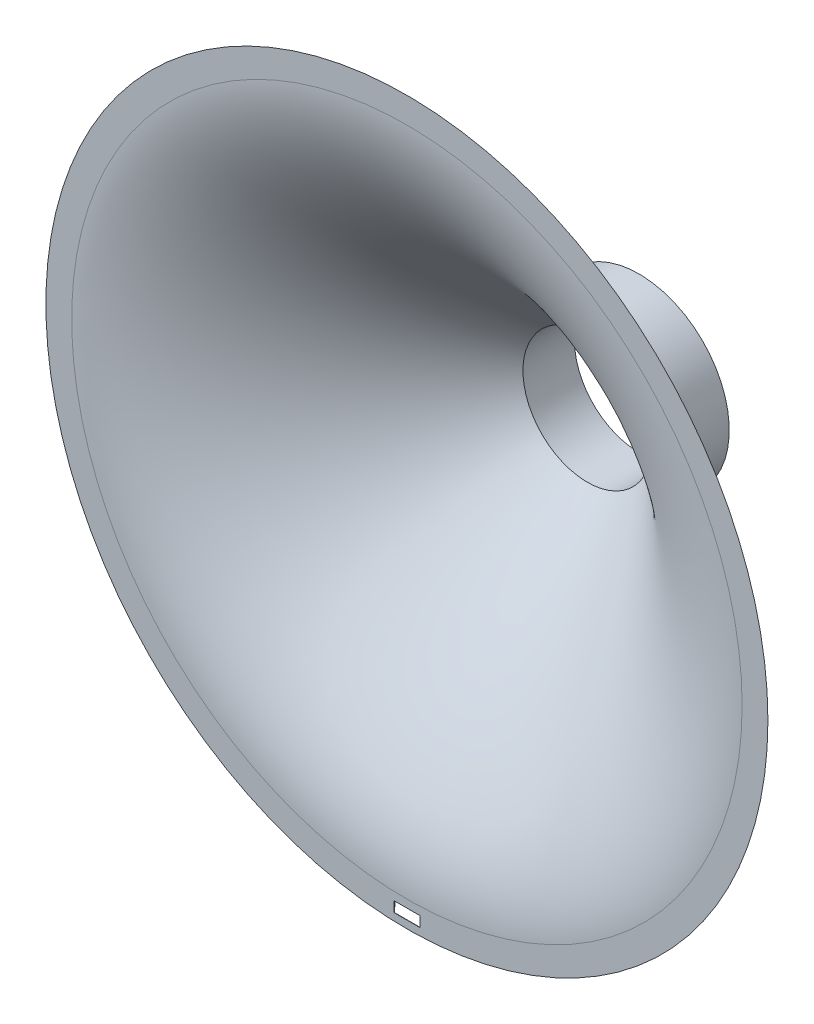
ISO-10303-21;
HEADER;
FILE_DESCRIPTION(('STEP AP214'),'2;1');
FILE_NAME('part.step','',(''),(''),'','','');
FILE_SCHEMA(('AUTOMOTIVE_DESIGN { 1 0 10303 214 1 1 1 1 }'));
ENDSEC;
DATA;
#1=APPLICATION_CONTEXT('core data for automotive mechanical design processes');
#2=APPLICATION_PROTOCOL_DEFINITION('international standard','automotive_design',2000,#1);
#3=PRODUCT_CONTEXT('',#1,'mechanical');
#4=PRODUCT('Part','Part','',(#3));
#5=PRODUCT_RELATED_PRODUCT_CATEGORY('part','',(#4));
#6=PRODUCT_DEFINITION_FORMATION('','',#4);
#7=PRODUCT_DEFINITION_CONTEXT('part definition',#1,'design');
#8=PRODUCT_DEFINITION('design','',#6,#7);
#9=PRODUCT_DEFINITION_SHAPE('','',#8);
#10=(LENGTH_UNIT() NAMED_UNIT(*) SI_UNIT(.MILLI.,.METRE.));
#11=(NAMED_UNIT(*) PLANE_ANGLE_UNIT() SI_UNIT($,.RADIAN.));
#12=(NAMED_UNIT(*) SI_UNIT($,.STERADIAN.) SOLID_ANGLE_UNIT());
#13=UNCERTAINTY_MEASURE_WITH_UNIT(LENGTH_MEASURE(1.E-05),#10,'distance_accuracy_value','');
#14=(GEOMETRIC_REPRESENTATION_CONTEXT(3) GLOBAL_UNCERTAINTY_ASSIGNED_CONTEXT((#13)) GLOBAL_UNIT_ASSIGNED_CONTEXT((#10,
#11,#12)) REPRESENTATION_CONTEXT('',''));
#15=CARTESIAN_POINT('',(0.,0.,0.));
#16=DIRECTION('',(0.,0.,1.));
#17=DIRECTION('',(1.,0.,0.));
#18=AXIS2_PLACEMENT_3D('',#15,#16,#17);
#19=CARTESIAN_POINT('',(0.,65.,0.));
#20=CARTESIAN_POINT('',(0.,47.4999999999999,0.));
#21=CARTESIAN_POINT('',(0.,24.8743686707647,-22.6256313292353));
#22=CARTESIAN_POINT('',(0.,12.5,-35.));
#23=B_SPLINE_CURVE_WITH_KNOTS('',3,(#19,#20,#21,#22),.UNSPECIFIED.,.F.,.F.,(4,4),(0.,1.),.UNSPECIFIED.);
#24=CARTESIAN_POINT('',(0.,0.,0.));
#25=DIRECTION('',(0.,0.,1.));
#26=AXIS1_PLACEMENT('',#24,#25);
#27=SURFACE_OF_REVOLUTION('',#23,#26);
#28=CARTESIAN_POINT('',(0.,0.,-35.));
#29=DIRECTION('',(0.,0.,1.));
#30=DIRECTION('',(1.,0.,0.));
#31=AXIS2_PLACEMENT_3D('',#28,#29,#30);
#32=CIRCLE('',#31,12.5);
#33=CARTESIAN_POINT('',(12.5,0.,-35.));
#34=VERTEX_POINT('',#33);
#35=EDGE_CURVE('E111',#34,#34,#32,.T.);
#36=ORIENTED_EDGE('',*,*,#35,.F.);
#37=EDGE_LOOP('',(#36));
#38=FACE_BOUND('',#37,.T.);
#39=CARTESIAN_POINT('',(0.,0.,0.));
#40=DIRECTION('',(0.,0.,1.));
#41=DIRECTION('',(1.,0.,0.));
#42=AXIS2_PLACEMENT_3D('',#39,#40,#41);
#43=CIRCLE('',#42,65.);
#44=CARTESIAN_POINT('',(65.,0.,0.));
#45=VERTEX_POINT('',#44);
#46=EDGE_CURVE('E181',#45,#45,#43,.T.);
#47=ORIENTED_EDGE('',*,*,#46,.T.);
#48=EDGE_LOOP('',(#47));
#49=FACE_BOUND('',#48,.T.);
#50=ADVANCED_FACE('F38',(#38,#49),#27,.T.);
#51=CARTESIAN_POINT('',(0.,65.,0.));
#52=DIRECTION('',(0.,0.,-1.));
#53=DIRECTION('',(-1.,0.,0.));
#54=AXIS2_PLACEMENT_3D('',#51,#52,#53);
#55=PLANE('',#54);
#56=DIRECTION('',(-1.,0.,0.));
#57=VECTOR('',#56,1.);
#58=CARTESIAN_POINT('',(-2.5,-66.5,0.));
#59=LINE('',#58,#57);
#60=CARTESIAN_POINT('',(2.5,-66.5,0.));
#61=VERTEX_POINT('',#60);
#62=CARTESIAN_POINT('',(-2.5,-66.5,0.));
#63=VERTEX_POINT('',#62);
#64=EDGE_CURVE('E97',#61,#63,#59,.T.);
#65=ORIENTED_EDGE('',*,*,#64,.F.);
#66=DIRECTION('',(0.,1.,0.));
#67=VECTOR('',#66,1.);
#68=CARTESIAN_POINT('',(2.5,-68.5,0.));
#69=LINE('',#68,#67);
#70=CARTESIAN_POINT('',(2.5,-68.5,0.));
#71=VERTEX_POINT('',#70);
#72=EDGE_CURVE('E59',#71,#61,#69,.T.);
#73=ORIENTED_EDGE('',*,*,#72,.F.);
#74=DIRECTION('',(1.,0.,0.));
#75=VECTOR('',#74,1.);
#76=CARTESIAN_POINT('',(-2.5,-68.5,0.));
#77=LINE('',#76,#75);
#78=CARTESIAN_POINT('',(-2.5,-68.5,0.));
#79=VERTEX_POINT('',#78);
#80=EDGE_CURVE('E104',#79,#71,#77,.T.);
#81=ORIENTED_EDGE('',*,*,#80,.F.);
#82=DIRECTION('',(0.,-1.,0.));
#83=VECTOR('',#82,1.);
#84=CARTESIAN_POINT('',(-2.5,-68.5,0.));
#85=LINE('',#84,#83);
#86=EDGE_CURVE('E88',#63,#79,#85,.T.);
#87=ORIENTED_EDGE('',*,*,#86,.F.);
#88=EDGE_LOOP('',(#65,#73,#81,#87));
#89=FACE_BOUND('',#88,.T.);
#90=ORIENTED_EDGE('',*,*,#46,.F.);
#91=EDGE_LOOP('',(#90));
#92=FACE_BOUND('',#91,.T.);
#93=CARTESIAN_POINT('',(0.,0.,0.));
#94=DIRECTION('',(0.,0.,1.));
#95=DIRECTION('',(1.,0.,0.));
#96=AXIS2_PLACEMENT_3D('',#93,#94,#95);
#97=CIRCLE('',#96,70.);
#98=CARTESIAN_POINT('',(70.,0.,0.));
#99=VERTEX_POINT('',#98);
#100=EDGE_CURVE('E182',#99,#99,#97,.T.);
#101=ORIENTED_EDGE('',*,*,#100,.T.);
#102=EDGE_LOOP('',(#101));
#103=FACE_BOUND('',#102,.T.);
#104=ADVANCED_FACE('F101',(#89,#92,#103),#55,.F.);
#105=CARTESIAN_POINT('',(0.,17.5,-35.));
#106=CARTESIAN_POINT('',(0.,29.8743686707647,-22.6256313292353));
#107=CARTESIAN_POINT('',(0.,52.4999999999999,0.));
#108=CARTESIAN_POINT('',(0.,70.,0.));
#109=B_SPLINE_CURVE_WITH_KNOTS('',3,(#105,#106,#107,#108),.UNSPECIFIED.,.F.,.F.,(4,4),(0.,1.),.UNSPECIFIED.);
#110=CARTESIAN_POINT('',(0.,0.,0.));
#111=DIRECTION('',(0.,0.,1.));
#112=AXIS1_PLACEMENT('',#110,#111);
#113=SURFACE_OF_REVOLUTION('',#109,#112);
#114=CARTESIAN_POINT('',(-2.5,-68.5,-0.0506025885433201));
#115=CARTESIAN_POINT('',(-1.66666666666666,-68.5,-0.0527195145771758));
#116=CARTESIAN_POINT('',(-0.833333333333329,-68.5,-0.0537779775941036));
#117=CARTESIAN_POINT('',(0.833333333333341,-68.5,-0.0537779775941039));
#118=CARTESIAN_POINT('',(1.66666666666668,-68.5,-0.0527195145771762));
#119=CARTESIAN_POINT('',(2.50000000000001,-68.5,-0.0506025885433208));
#120=B_SPLINE_CURVE_WITH_KNOTS('',3,(#114,#115,#116,#117,#118,#119),.UNSPECIFIED.,.F.,.F.,(4,2,
4),(0.,2.50000201661832,5.00000403323663),.UNSPECIFIED.);
#121=CARTESIAN_POINT('',(-2.5,-68.5,-0.0506025885433203));
#122=VERTEX_POINT('',#121);
#123=CARTESIAN_POINT('',(2.5,-68.5,-0.0506025885433185));
#124=VERTEX_POINT('',#123);
#125=EDGE_CURVE('E52',#122,#124,#120,.T.);
#126=ORIENTED_EDGE('',*,*,#125,.T.);
#127=CARTESIAN_POINT('',(2.50000000000001,-68.5,-0.0506025885433187));
#128=CARTESIAN_POINT('',(2.5,-68.3883848780378,-0.0582541192058575));
#129=CARTESIAN_POINT('',(2.5,-68.2768278855478,-0.066744744681041));
#130=CARTESIAN_POINT('',(2.5,-68.0538954673799,-0.0853612171170863));
#131=CARTESIAN_POINT('',(2.5,-67.9425199867613,-0.0954864057250156));
#132=CARTESIAN_POINT('',(2.5,-67.7199474166826,-0.117333163391907));
#133=CARTESIAN_POINT('',(2.5,-67.6087502972389,-0.129054427476948));
#134=CARTESIAN_POINT('',(2.5,-67.3865329507545,-0.154055796062725));
#135=CARTESIAN_POINT('',(2.5,-67.2755127215697,-0.167335881520907));
#136=CARTESIAN_POINT('',(2.5,-67.0536424186679,-0.195419302879291));
#137=CARTESIAN_POINT('',(2.5,-66.9427923840808,-0.210222947546478));
#138=CARTESIAN_POINT('',(2.5,-66.7212575801585,-0.24131926758496));
#139=CARTESIAN_POINT('',(2.5,-66.6105728912996,-0.257612516504706));
#140=CARTESIAN_POINT('',(2.50000000000001,-66.5,-0.274628828340648));
#141=B_SPLINE_CURVE_WITH_KNOTS('',3,(#127,#128,#129,#130,#131,#132,#133,#134,#135,#136,#137,
#138,#139,#140),.UNSPECIFIED.,.F.,.F.,(4,2,2,2,2,2,4),(0.,0.335627196633608,0.671119548441498,
1.00654788496971,1.34197212433344,1.67746447567992,2.01308655146694),.UNSPECIFIED.);
#142=CARTESIAN_POINT('',(2.5,-66.5,-0.274628828340654));
#143=VERTEX_POINT('',#142);
#144=EDGE_CURVE('E11',#124,#143,#141,.T.);
#145=ORIENTED_EDGE('',*,*,#144,.T.);
#146=CARTESIAN_POINT('',(2.50000000000001,-66.5,-0.274628828340653));
#147=CARTESIAN_POINT('',(1.66666666666667,-66.5,-0.279481447595185));
#148=CARTESIAN_POINT('',(0.833333333333338,-66.5,-0.28190775722245));
#149=CARTESIAN_POINT('',(-0.83333333333333,-66.5,-0.281907757222448));
#150=CARTESIAN_POINT('',(-1.66666666666666,-66.5,-0.279481447595182));
#151=CARTESIAN_POINT('',(-2.5,-66.5,-0.274628828340649));
#152=B_SPLINE_CURVE_WITH_KNOTS('',3,(#146,#147,#148,#149,#150,#151),.UNSPECIFIED.,.F.,.F.,(4,2,
4),(0.,2.50001059653868,5.00002119307735),.UNSPECIFIED.);
#153=CARTESIAN_POINT('',(-2.5,-66.5,-0.274628828340652));
#154=VERTEX_POINT('',#153);
#155=EDGE_CURVE('E138',#143,#154,#152,.T.);
#156=ORIENTED_EDGE('',*,*,#155,.T.);
#157=CARTESIAN_POINT('',(-2.5,-66.5,-0.274628828340652));
#158=CARTESIAN_POINT('',(-2.5,-66.6105728912997,-0.257612516504704));
#159=CARTESIAN_POINT('',(-2.5,-66.7212575801585,-0.241319267584958));
#160=CARTESIAN_POINT('',(-2.5,-66.9427923840808,-0.210222947546476));
#161=CARTESIAN_POINT('',(-2.5,-67.0536424186679,-0.195419302879289));
#162=CARTESIAN_POINT('',(-2.5,-67.2755127215698,-0.167335881520907));
#163=CARTESIAN_POINT('',(-2.5,-67.3865329507545,-0.154055796062725));
#164=CARTESIAN_POINT('',(-2.5,-67.6087502972389,-0.129054427476948));
#165=CARTESIAN_POINT('',(-2.5,-67.7199474166826,-0.117333163391907));
#166=CARTESIAN_POINT('',(-2.5,-67.9425199867613,-0.0954864057250155));
#167=CARTESIAN_POINT('',(-2.5,-68.0538954673799,-0.0853612171170859));
#168=CARTESIAN_POINT('',(-2.5,-68.2768278855478,-0.0667447446810405));
#169=CARTESIAN_POINT('',(-2.5,-68.3883848780378,-0.0582541192058573));
#170=CARTESIAN_POINT('',(-2.5,-68.5,-0.05060258854332));
#171=B_SPLINE_CURVE_WITH_KNOTS('',3,(#157,#158,#159,#160,#161,#162,#163,#164,#165,#166,#167,
#168,#169,#170),.UNSPECIFIED.,.F.,.F.,(4,2,2,2,2,2,4),(0.,0.335622075787004,0.671114427133512,
1.00653866649722,1.34196700302543,1.67745935483331,2.01308655146692),.UNSPECIFIED.);
#172=EDGE_CURVE('E91',#154,#122,#171,.T.);
#173=ORIENTED_EDGE('',*,*,#172,.T.);
#174=EDGE_LOOP('',(#126,#145,#156,#173));
#175=FACE_BOUND('',#174,.T.);
#176=ORIENTED_EDGE('',*,*,#100,.F.);
#177=EDGE_LOOP('',(#176));
#178=FACE_BOUND('',#177,.T.);
#179=CARTESIAN_POINT('',(0.,0.,-35.));
#180=DIRECTION('',(0.,0.,-1.));
#181=DIRECTION('',(-1.,0.,0.));
#182=AXIS2_PLACEMENT_3D('',#179,#180,#181);
#183=CIRCLE('',#182,17.5);
#184=CARTESIAN_POINT('',(-17.5,0.,-35.));
#185=VERTEX_POINT('',#184);
#186=EDGE_CURVE('E198',#185,#185,#183,.T.);
#187=ORIENTED_EDGE('',*,*,#186,.F.);
#188=EDGE_LOOP('',(#187));
#189=FACE_BOUND('',#188,.T.);
#190=ADVANCED_FACE('F128',(#175,#178,#189),#113,.T.);
#191=CARTESIAN_POINT('',(2.5,-68.5,-10.));
#192=DIRECTION('',(1.,0.,0.));
#193=DIRECTION('',(0.,0.,-1.));
#194=AXIS2_PLACEMENT_3D('',#191,#192,#193);
#195=PLANE('',#194);
#196=DIRECTION('',(0.,0.,1.));
#197=VECTOR('',#196,1.);
#198=CARTESIAN_POINT('',(2.5,-68.5,-10.));
#199=LINE('',#198,#197);
#200=EDGE_CURVE('E109',#124,#71,#199,.T.);
#201=ORIENTED_EDGE('',*,*,#200,.T.);
#202=ORIENTED_EDGE('',*,*,#72,.T.);
#203=DIRECTION('',(0.,0.,1.));
#204=VECTOR('',#203,1.);
#205=CARTESIAN_POINT('',(2.5,-66.5,-10.));
#206=LINE('',#205,#204);
#207=EDGE_CURVE('E94',#143,#61,#206,.T.);
#208=ORIENTED_EDGE('',*,*,#207,.F.);
#209=ORIENTED_EDGE('',*,*,#144,.F.);
#210=EDGE_LOOP('',(#201,#202,#208,#209));
#211=FACE_BOUND('',#210,.T.);
#212=ADVANCED_FACE('F131',(#211),#195,.F.);
#213=CARTESIAN_POINT('',(-2.5,-68.5,-10.));
#214=DIRECTION('',(0.,-1.,0.));
#215=DIRECTION('',(0.,0.,-1.));
#216=AXIS2_PLACEMENT_3D('',#213,#214,#215);
#217=PLANE('',#216);
#218=DIRECTION('',(0.,0.,1.));
#219=VECTOR('',#218,1.);
#220=CARTESIAN_POINT('',(-2.5,-68.5,-10.));
#221=LINE('',#220,#219);
#222=EDGE_CURVE('E93',#122,#79,#221,.T.);
#223=ORIENTED_EDGE('',*,*,#222,.T.);
#224=ORIENTED_EDGE('',*,*,#80,.T.);
#225=ORIENTED_EDGE('',*,*,#200,.F.);
#226=ORIENTED_EDGE('',*,*,#125,.F.);
#227=EDGE_LOOP('',(#223,#224,#225,#226));
#228=FACE_BOUND('',#227,.T.);
#229=ADVANCED_FACE('F157',(#228),#217,.F.);
#230=CARTESIAN_POINT('',(-2.5,-68.5,-10.));
#231=DIRECTION('',(-1.,0.,0.));
#232=DIRECTION('',(0.,0.,1.));
#233=AXIS2_PLACEMENT_3D('',#230,#231,#232);
#234=PLANE('',#233);
#235=DIRECTION('',(0.,0.,1.));
#236=VECTOR('',#235,1.);
#237=CARTESIAN_POINT('',(-2.5,-66.5,-10.));
#238=LINE('',#237,#236);
#239=EDGE_CURVE('E67',#154,#63,#238,.T.);
#240=ORIENTED_EDGE('',*,*,#239,.T.);
#241=ORIENTED_EDGE('',*,*,#86,.T.);
#242=ORIENTED_EDGE('',*,*,#222,.F.);
#243=ORIENTED_EDGE('',*,*,#172,.F.);
#244=EDGE_LOOP('',(#240,#241,#242,#243));
#245=FACE_BOUND('',#244,.T.);
#246=ADVANCED_FACE('F85',(#245),#234,.F.);
#247=CARTESIAN_POINT('',(-2.5,-66.5,-10.));
#248=DIRECTION('',(0.,1.,0.));
#249=DIRECTION('',(0.,0.,1.));
#250=AXIS2_PLACEMENT_3D('',#247,#248,#249);
#251=PLANE('',#250);
#252=ORIENTED_EDGE('',*,*,#207,.T.);
#253=ORIENTED_EDGE('',*,*,#64,.T.);
#254=ORIENTED_EDGE('',*,*,#239,.F.);
#255=ORIENTED_EDGE('',*,*,#155,.F.);
#256=EDGE_LOOP('',(#252,#253,#254,#255));
#257=FACE_BOUND('',#256,.T.);
#258=ADVANCED_FACE('F98',(#257),#251,.F.);
#259=CARTESIAN_POINT('',(0.,0.,-45.));
#260=DIRECTION('',(0.,0.,-1.));
#261=DIRECTION('',(-1.,0.,0.));
#262=AXIS2_PLACEMENT_3D('',#259,#260,#261);
#263=PLANE('',#262);
#264=CARTESIAN_POINT('',(0.,0.,-45.));
#265=DIRECTION('',(0.,0.,-1.));
#266=DIRECTION('',(-1.,0.,0.));
#267=AXIS2_PLACEMENT_3D('',#264,#265,#266);
#268=CIRCLE('',#267,17.5);
#269=CARTESIAN_POINT('',(-17.5,0.,-45.));
#270=VERTEX_POINT('',#269);
#271=EDGE_CURVE('E201',#270,#270,#268,.T.);
#272=ORIENTED_EDGE('',*,*,#271,.T.);
#273=EDGE_LOOP('',(#272));
#274=FACE_BOUND('',#273,.T.);
#275=CARTESIAN_POINT('',(0.,0.,-45.));
#276=DIRECTION('',(0.,0.,-1.));
#277=DIRECTION('',(-1.,0.,0.));
#278=AXIS2_PLACEMENT_3D('',#275,#276,#277);
#279=CIRCLE('',#278,12.5);
#280=CARTESIAN_POINT('',(-12.5,0.,-45.));
#281=VERTEX_POINT('',#280);
#282=EDGE_CURVE('E196',#281,#281,#279,.T.);
#283=ORIENTED_EDGE('',*,*,#282,.F.);
#284=EDGE_LOOP('',(#283));
#285=FACE_BOUND('',#284,.T.);
#286=ADVANCED_FACE('F168',(#274,#285),#263,.T.);
#287=CARTESIAN_POINT('',(0.,0.,-45.));
#288=DIRECTION('',(0.,0.,1.));
#289=DIRECTION('',(1.,0.,0.));
#290=AXIS2_PLACEMENT_3D('',#287,#288,#289);
#291=CYLINDRICAL_SURFACE('',#290,17.5);
#292=ORIENTED_EDGE('',*,*,#271,.F.);
#293=EDGE_LOOP('',(#292));
#294=FACE_BOUND('',#293,.T.);
#295=ORIENTED_EDGE('',*,*,#186,.T.);
#296=EDGE_LOOP('',(#295));
#297=FACE_BOUND('',#296,.T.);
#298=ADVANCED_FACE('F162',(#294,#297),#291,.T.);
#299=CARTESIAN_POINT('',(0.,0.,-45.));
#300=DIRECTION('',(0.,0.,1.));
#301=DIRECTION('',(1.,0.,0.));
#302=AXIS2_PLACEMENT_3D('',#299,#300,#301);
#303=CYLINDRICAL_SURFACE('',#302,12.5);
#304=ORIENTED_EDGE('',*,*,#282,.T.);
#305=EDGE_LOOP('',(#304));
#306=FACE_BOUND('',#305,.T.);
#307=ORIENTED_EDGE('',*,*,#35,.T.);
#308=EDGE_LOOP('',(#307));
#309=FACE_BOUND('',#308,.T.);
#310=ADVANCED_FACE('F187',(#306,#309),#303,.F.);
#311=CLOSED_SHELL('',(#50,#104,#190,#212,#229,#246,#258,#286,#298,#310));
#312=MANIFOLD_SOLID_BREP('B2',#311);
#313=ADVANCED_BREP_SHAPE_REPRESENTATION('',(#18,#312),#14);
#314=SHAPE_DEFINITION_REPRESENTATION(#9,#313);
ENDSEC;
END-ISO-10303-21;
